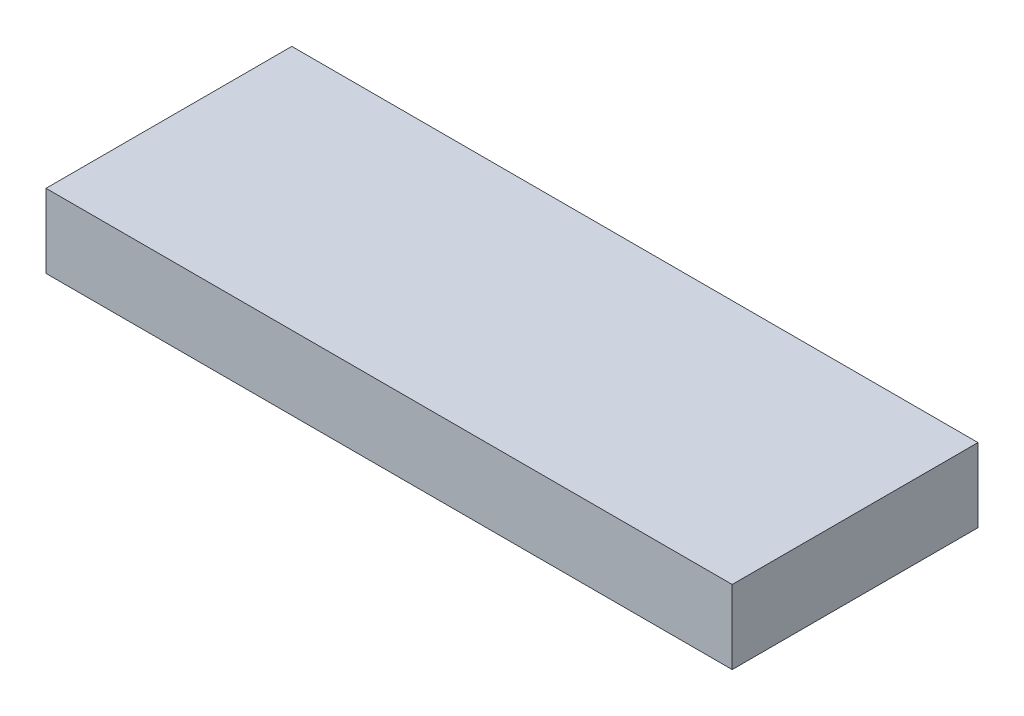
ISO-10303-21;
HEADER;
FILE_DESCRIPTION(('STEP AP214'),'2;1');
FILE_NAME('part.step','',(''),(''),'','','');
FILE_SCHEMA(('AUTOMOTIVE_DESIGN { 1 0 10303 214 1 1 1 1 }'));
ENDSEC;
DATA;
#1=APPLICATION_CONTEXT('core data for automotive mechanical design processes');
#2=APPLICATION_PROTOCOL_DEFINITION('international standard','automotive_design',2000,#1);
#3=PRODUCT_CONTEXT('',#1,'mechanical');
#4=PRODUCT('Part','Part','',(#3));
#5=PRODUCT_RELATED_PRODUCT_CATEGORY('part','',(#4));
#6=PRODUCT_DEFINITION_FORMATION('','',#4);
#7=PRODUCT_DEFINITION_CONTEXT('part definition',#1,'design');
#8=PRODUCT_DEFINITION('design','',#6,#7);
#9=PRODUCT_DEFINITION_SHAPE('','',#8);
#10=(LENGTH_UNIT() NAMED_UNIT(*) SI_UNIT(.MILLI.,.METRE.));
#11=(NAMED_UNIT(*) PLANE_ANGLE_UNIT() SI_UNIT($,.RADIAN.));
#12=(NAMED_UNIT(*) SI_UNIT($,.STERADIAN.) SOLID_ANGLE_UNIT());
#13=UNCERTAINTY_MEASURE_WITH_UNIT(LENGTH_MEASURE(1.E-05),#10,'distance_accuracy_value','');
#14=(GEOMETRIC_REPRESENTATION_CONTEXT(3) GLOBAL_UNCERTAINTY_ASSIGNED_CONTEXT((#13)) GLOBAL_UNIT_ASSIGNED_CONTEXT((#10,
#11,#12)) REPRESENTATION_CONTEXT('',''));
#15=CARTESIAN_POINT('',(0.,0.,0.));
#16=DIRECTION('',(0.,0.,1.));
#17=DIRECTION('',(1.,0.,0.));
#18=AXIS2_PLACEMENT_3D('',#15,#16,#17);
#19=CARTESIAN_POINT('',(-300.,46.99,23.));
#20=DIRECTION('',(0.,0.,1.));
#21=DIRECTION('',(1.,0.,0.));
#22=AXIS2_PLACEMENT_3D('',#19,#20,#21);
#23=PLANE('',#22);
#24=DIRECTION('',(0.,1.,0.));
#25=VECTOR('',#24,1.);
#26=CARTESIAN_POINT('',(-300.,46.99,23.));
#27=LINE('',#26,#25);
#28=CARTESIAN_POINT('',(-300.,47.,23.));
#29=VERTEX_POINT('',#28);
#30=CARTESIAN_POINT('',(-300.,50.,23.));
#31=VERTEX_POINT('',#30);
#32=EDGE_CURVE('E84',#29,#31,#27,.T.);
#33=ORIENTED_EDGE('',*,*,#32,.F.);
#34=DIRECTION('',(1.,0.,0.));
#35=VECTOR('',#34,1.);
#36=CARTESIAN_POINT('',(300.,47.,22.9999999999999));
#37=LINE('',#36,#35);
#38=CARTESIAN_POINT('',(-272.082574829783,47.,23.));
#39=VERTEX_POINT('',#38);
#40=EDGE_CURVE('E93',#29,#39,#37,.T.);
#41=ORIENTED_EDGE('',*,*,#40,.T.);
#42=DIRECTION('',(0.,1.,0.));
#43=VECTOR('',#42,1.);
#44=CARTESIAN_POINT('',(-272.082574829783,46.99,23.));
#45=LINE('',#44,#43);
#46=CARTESIAN_POINT('',(-272.082574829783,50.,23.));
#47=VERTEX_POINT('',#46);
#48=EDGE_CURVE('E57',#39,#47,#45,.T.);
#49=ORIENTED_EDGE('',*,*,#48,.T.);
#50=DIRECTION('',(-1.,0.,0.));
#51=VECTOR('',#50,1.);
#52=CARTESIAN_POINT('',(-300.,50.,23.));
#53=LINE('',#52,#51);
#54=EDGE_CURVE('E11',#47,#31,#53,.T.);
#55=ORIENTED_EDGE('',*,*,#54,.T.);
#56=EDGE_LOOP('',(#33,#41,#49,#55));
#57=FACE_BOUND('',#56,.T.);
#58=ADVANCED_FACE('F34',(#57),#23,.T.);
#59=CARTESIAN_POINT('',(-300.,46.99,13.));
#60=DIRECTION('',(0.,0.,-1.));
#61=DIRECTION('',(-1.,0.,0.));
#62=AXIS2_PLACEMENT_3D('',#59,#60,#61);
#63=PLANE('',#62);
#64=DIRECTION('',(0.,1.,0.));
#65=VECTOR('',#64,1.);
#66=CARTESIAN_POINT('',(-272.082574829783,46.99,13.));
#67=LINE('',#66,#65);
#68=CARTESIAN_POINT('',(-272.082574829783,47.,13.));
#69=VERTEX_POINT('',#68);
#70=CARTESIAN_POINT('',(-272.082574829783,50.,13.));
#71=VERTEX_POINT('',#70);
#72=EDGE_CURVE('E50',#69,#71,#67,.T.);
#73=ORIENTED_EDGE('',*,*,#72,.F.);
#74=DIRECTION('',(-1.,0.,0.));
#75=VECTOR('',#74,1.);
#76=CARTESIAN_POINT('',(300.,47.,13.));
#77=LINE('',#76,#75);
#78=CARTESIAN_POINT('',(-300.,47.,13.));
#79=VERTEX_POINT('',#78);
#80=EDGE_CURVE('E87',#69,#79,#77,.T.);
#81=ORIENTED_EDGE('',*,*,#80,.T.);
#82=DIRECTION('',(0.,-1.,0.));
#83=VECTOR('',#82,1.);
#84=CARTESIAN_POINT('',(-300.,46.99,13.));
#85=LINE('',#84,#83);
#86=CARTESIAN_POINT('',(-300.,50.,13.));
#87=VERTEX_POINT('',#86);
#88=EDGE_CURVE('E77',#87,#79,#85,.T.);
#89=ORIENTED_EDGE('',*,*,#88,.F.);
#90=DIRECTION('',(1.,0.,0.));
#91=VECTOR('',#90,1.);
#92=CARTESIAN_POINT('',(-300.,50.,13.));
#93=LINE('',#92,#91);
#94=EDGE_CURVE('E98',#87,#71,#93,.T.);
#95=ORIENTED_EDGE('',*,*,#94,.T.);
#96=EDGE_LOOP('',(#73,#81,#89,#95));
#97=FACE_BOUND('',#96,.T.);
#98=ADVANCED_FACE('F88',(#97),#63,.T.);
#99=CARTESIAN_POINT('',(-272.082574829783,46.99,13.));
#100=DIRECTION('',(1.,0.,0.));
#101=DIRECTION('',(0.,0.,-1.));
#102=AXIS2_PLACEMENT_3D('',#99,#100,#101);
#103=PLANE('',#102);
#104=ORIENTED_EDGE('',*,*,#48,.F.);
#105=DIRECTION('',(0.,0.,-1.));
#106=VECTOR('',#105,1.);
#107=CARTESIAN_POINT('',(-272.082574829783,47.,3.));
#108=LINE('',#107,#106);
#109=EDGE_CURVE('E37',#39,#69,#108,.T.);
#110=ORIENTED_EDGE('',*,*,#109,.T.);
#111=ORIENTED_EDGE('',*,*,#72,.T.);
#112=DIRECTION('',(0.,0.,1.));
#113=VECTOR('',#112,1.);
#114=CARTESIAN_POINT('',(-272.082574829783,50.,60.));
#115=LINE('',#114,#113);
#116=EDGE_CURVE('E42',#71,#47,#115,.T.);
#117=ORIENTED_EDGE('',*,*,#116,.T.);
#118=EDGE_LOOP('',(#104,#110,#111,#117));
#119=FACE_BOUND('',#118,.T.);
#120=ADVANCED_FACE('F104',(#119),#103,.T.);
#121=CARTESIAN_POINT('',(-300.,0.,0.));
#122=DIRECTION('',(-1.,0.,0.));
#123=DIRECTION('',(0.,0.,1.));
#124=AXIS2_PLACEMENT_3D('',#121,#122,#123);
#125=PLANE('',#124);
#126=DIRECTION('',(0.,0.,1.));
#127=VECTOR('',#126,1.);
#128=CARTESIAN_POINT('',(-300.,47.,3.));
#129=LINE('',#128,#127);
#130=EDGE_CURVE('E80',#79,#29,#129,.T.);
#131=ORIENTED_EDGE('',*,*,#130,.T.);
#132=ORIENTED_EDGE('',*,*,#32,.T.);
#133=DIRECTION('',(0.,0.,-1.));
#134=VECTOR('',#133,1.);
#135=CARTESIAN_POINT('',(-300.,50.,60.));
#136=LINE('',#135,#134);
#137=EDGE_CURVE('E82',#31,#87,#136,.T.);
#138=ORIENTED_EDGE('',*,*,#137,.T.);
#139=ORIENTED_EDGE('',*,*,#88,.T.);
#140=EDGE_LOOP('',(#131,#132,#138,#139));
#141=FACE_BOUND('',#140,.T.);
#142=ADVANCED_FACE('F78',(#141),#125,.T.);
#143=CARTESIAN_POINT('',(-300.,50.,60.));
#144=DIRECTION('',(0.,-1.,0.));
#145=DIRECTION('',(0.,0.,-1.));
#146=AXIS2_PLACEMENT_3D('',#143,#144,#145);
#147=PLANE('',#146);
#148=ORIENTED_EDGE('',*,*,#94,.F.);
#149=ORIENTED_EDGE('',*,*,#137,.F.);
#150=ORIENTED_EDGE('',*,*,#54,.F.);
#151=ORIENTED_EDGE('',*,*,#116,.F.);
#152=EDGE_LOOP('',(#148,#149,#150,#151));
#153=FACE_BOUND('',#152,.T.);
#154=ADVANCED_FACE('F108',(#153),#147,.F.);
#155=CARTESIAN_POINT('',(300.,47.,3.));
#156=DIRECTION('',(0.,1.,0.));
#157=DIRECTION('',(0.,0.,1.));
#158=AXIS2_PLACEMENT_3D('',#155,#156,#157);
#159=PLANE('',#158);
#160=ORIENTED_EDGE('',*,*,#80,.F.);
#161=ORIENTED_EDGE('',*,*,#109,.F.);
#162=ORIENTED_EDGE('',*,*,#40,.F.);
#163=ORIENTED_EDGE('',*,*,#130,.F.);
#164=EDGE_LOOP('',(#160,#161,#162,#163));
#165=FACE_BOUND('',#164,.T.);
#166=ADVANCED_FACE('F92',(#165),#159,.F.);
#167=CLOSED_SHELL('',(#58,#98,#120,#142,#154,#166));
#168=MANIFOLD_SOLID_BREP('B2',#167);
#169=ADVANCED_BREP_SHAPE_REPRESENTATION('',(#18,#168),#14);
#170=SHAPE_DEFINITION_REPRESENTATION(#9,#169);
ENDSEC;
END-ISO-10303-21;
